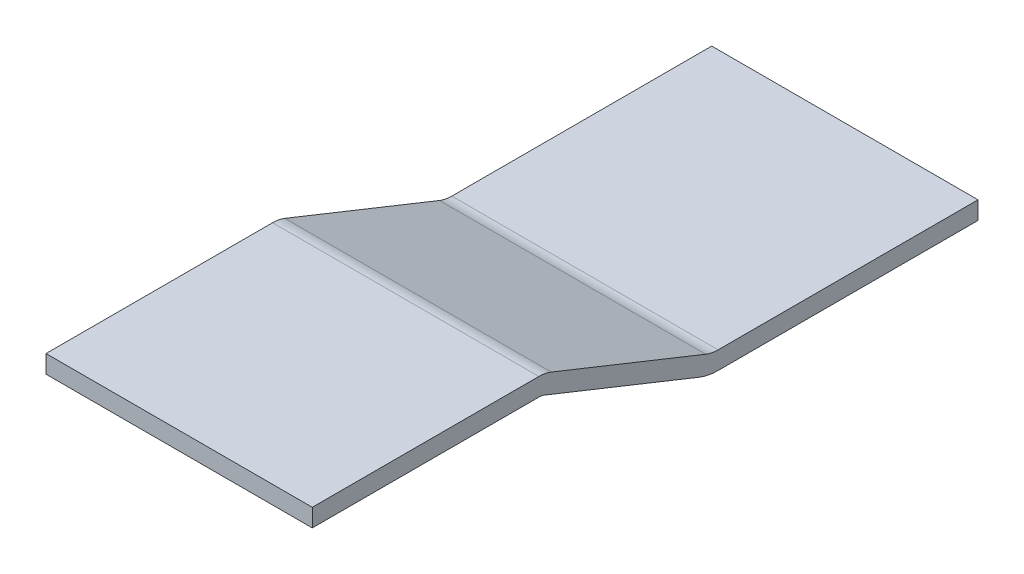
ISO-10303-21;
HEADER;
FILE_DESCRIPTION(('STEP AP214'),'2;1');
FILE_NAME('part.step','',(''),(''),'','','');
FILE_SCHEMA(('AUTOMOTIVE_DESIGN { 1 0 10303 214 1 1 1 1 }'));
ENDSEC;
DATA;
#1=APPLICATION_CONTEXT('core data for automotive mechanical design processes');
#2=APPLICATION_PROTOCOL_DEFINITION('international standard','automotive_design',2000,#1);
#3=PRODUCT_CONTEXT('',#1,'mechanical');
#4=PRODUCT('Part','Part','',(#3));
#5=PRODUCT_RELATED_PRODUCT_CATEGORY('part','',(#4));
#6=PRODUCT_DEFINITION_FORMATION('','',#4);
#7=PRODUCT_DEFINITION_CONTEXT('part definition',#1,'design');
#8=PRODUCT_DEFINITION('design','',#6,#7);
#9=PRODUCT_DEFINITION_SHAPE('','',#8);
#10=(LENGTH_UNIT() NAMED_UNIT(*) SI_UNIT(.MILLI.,.METRE.));
#11=(NAMED_UNIT(*) PLANE_ANGLE_UNIT() SI_UNIT($,.RADIAN.));
#12=(NAMED_UNIT(*) SI_UNIT($,.STERADIAN.) SOLID_ANGLE_UNIT());
#13=UNCERTAINTY_MEASURE_WITH_UNIT(LENGTH_MEASURE(1.E-05),#10,'distance_accuracy_value','');
#14=(GEOMETRIC_REPRESENTATION_CONTEXT(3) GLOBAL_UNCERTAINTY_ASSIGNED_CONTEXT((#13)) GLOBAL_UNIT_ASSIGNED_CONTEXT((#10,
#11,#12)) REPRESENTATION_CONTEXT('',''));
#15=CARTESIAN_POINT('',(0.,0.,0.));
#16=DIRECTION('',(0.,0.,1.));
#17=DIRECTION('',(1.,0.,0.));
#18=AXIS2_PLACEMENT_3D('',#15,#16,#17);
#19=CARTESIAN_POINT('',(25.4,-16.1163,-55.8093473939781));
#20=DIRECTION('',(0.,1.,0.));
#21=DIRECTION('',(0.,0.,1.));
#22=AXIS2_PLACEMENT_3D('',#19,#20,#21);
#23=PLANE('',#22);
#24=DIRECTION('',(0.,0.,-1.));
#25=VECTOR('',#24,1.);
#26=CARTESIAN_POINT('',(-25.4,-16.1163,-55.8093473939781));
#27=LINE('',#26,#25);
#28=CARTESIAN_POINT('',(-25.4,-16.1163,-55.8093473939781));
#29=VERTEX_POINT('',#28);
#30=CARTESIAN_POINT('',(-25.4,-16.1163,-105.386449131326));
#31=VERTEX_POINT('',#30);
#32=EDGE_CURVE('E153',#29,#31,#27,.T.);
#33=ORIENTED_EDGE('',*,*,#32,.T.);
#34=DIRECTION('',(-1.,0.,0.));
#35=VECTOR('',#34,1.);
#36=CARTESIAN_POINT('',(25.4,-16.1163,-105.386449131326));
#37=LINE('',#36,#35);
#38=CARTESIAN_POINT('',(25.4,-16.1163,-105.386449131326));
#39=VERTEX_POINT('',#38);
#40=EDGE_CURVE('E11',#39,#31,#37,.T.);
#41=ORIENTED_EDGE('',*,*,#40,.F.);
#42=DIRECTION('',(0.,0.,-1.));
#43=VECTOR('',#42,1.);
#44=CARTESIAN_POINT('',(25.4,-16.1163,-55.8093473939781));
#45=LINE('',#44,#43);
#46=CARTESIAN_POINT('',(25.4,-16.1163,-55.8093473939781));
#47=VERTEX_POINT('',#46);
#48=EDGE_CURVE('E101',#47,#39,#45,.T.);
#49=ORIENTED_EDGE('',*,*,#48,.F.);
#50=DIRECTION('',(-1.,0.,0.));
#51=VECTOR('',#50,1.);
#52=CARTESIAN_POINT('',(25.4,-16.1163,-55.8093473939781));
#53=LINE('',#52,#51);
#54=EDGE_CURVE('E149',#47,#29,#53,.T.);
#55=ORIENTED_EDGE('',*,*,#54,.T.);
#56=EDGE_LOOP('',(#33,#41,#49,#55));
#57=FACE_BOUND('',#56,.T.);
#58=ADVANCED_FACE('F33',(#57),#23,.F.);
#59=CARTESIAN_POINT('',(25.4,-12.7,-105.386449131326));
#60=DIRECTION('',(0.,0.,-1.));
#61=DIRECTION('',(-1.,0.,0.));
#62=AXIS2_PLACEMENT_3D('',#59,#60,#61);
#63=PLANE('',#62);
#64=DIRECTION('',(0.,-1.,0.));
#65=VECTOR('',#64,1.);
#66=CARTESIAN_POINT('',(-25.4,-12.7,-105.386449131326));
#67=LINE('',#66,#65);
#68=CARTESIAN_POINT('',(-25.4,-12.7,-105.386449131326));
#69=VERTEX_POINT('',#68);
#70=EDGE_CURVE('E156',#69,#31,#67,.T.);
#71=ORIENTED_EDGE('',*,*,#70,.F.);
#72=DIRECTION('',(-1.,0.,0.));
#73=VECTOR('',#72,1.);
#74=CARTESIAN_POINT('',(25.4,-12.7,-105.386449131326));
#75=LINE('',#74,#73);
#76=CARTESIAN_POINT('',(25.4,-12.7,-105.386449131326));
#77=VERTEX_POINT('',#76);
#78=EDGE_CURVE('E41',#77,#69,#75,.T.);
#79=ORIENTED_EDGE('',*,*,#78,.F.);
#80=DIRECTION('',(0.,-1.,0.));
#81=VECTOR('',#80,1.);
#82=CARTESIAN_POINT('',(25.4,-12.7,-105.386449131326));
#83=LINE('',#82,#81);
#84=EDGE_CURVE('E218',#77,#39,#83,.T.);
#85=ORIENTED_EDGE('',*,*,#84,.T.);
#86=ORIENTED_EDGE('',*,*,#40,.T.);
#87=EDGE_LOOP('',(#71,#79,#85,#86));
#88=FACE_BOUND('',#87,.T.);
#89=ADVANCED_FACE('F205',(#88),#63,.T.);
#90=CARTESIAN_POINT('',(25.4,-12.7,-55.8093473939781));
#91=DIRECTION('',(0.,1.,0.));
#92=DIRECTION('',(0.,0.,1.));
#93=AXIS2_PLACEMENT_3D('',#90,#91,#92);
#94=PLANE('',#93);
#95=DIRECTION('',(0.,0.,-1.));
#96=VECTOR('',#95,1.);
#97=CARTESIAN_POINT('',(-25.4,-12.7,-55.8093473939781));
#98=LINE('',#97,#96);
#99=CARTESIAN_POINT('',(-25.4,-12.7,-55.8093473939781));
#100=VERTEX_POINT('',#99);
#101=EDGE_CURVE('E159',#100,#69,#98,.T.);
#102=ORIENTED_EDGE('',*,*,#101,.F.);
#103=DIRECTION('',(-1.,0.,0.));
#104=VECTOR('',#103,1.);
#105=CARTESIAN_POINT('',(25.4,-12.7,-55.8093473939781));
#106=LINE('',#105,#104);
#107=CARTESIAN_POINT('',(25.4,-12.7,-55.8093473939781));
#108=VERTEX_POINT('',#107);
#109=EDGE_CURVE('E195',#108,#100,#106,.T.);
#110=ORIENTED_EDGE('',*,*,#109,.F.);
#111=DIRECTION('',(0.,0.,-1.));
#112=VECTOR('',#111,1.);
#113=CARTESIAN_POINT('',(25.4,-12.7,-55.8093473939781));
#114=LINE('',#113,#112);
#115=EDGE_CURVE('E202',#108,#77,#114,.T.);
#116=ORIENTED_EDGE('',*,*,#115,.T.);
#117=ORIENTED_EDGE('',*,*,#78,.T.);
#118=EDGE_LOOP('',(#102,#110,#116,#117));
#119=FACE_BOUND('',#118,.T.);
#120=ADVANCED_FACE('F200',(#119),#94,.T.);
#121=CARTESIAN_POINT('',(25.4,-6.35,-55.8093473939781));
#122=DIRECTION('',(-1.,0.,0.));
#123=DIRECTION('',(0.,0.,1.));
#124=AXIS2_PLACEMENT_3D('',#121,#122,#123);
#125=CYLINDRICAL_SURFACE('',#124,6.35);
#126=CARTESIAN_POINT('',(-25.4,-6.35,-55.8093473939781));
#127=DIRECTION('',(1.,0.,0.));
#128=DIRECTION('',(0.,0.,-1.));
#129=AXIS2_PLACEMENT_3D('',#126,#127,#128);
#130=CIRCLE('',#129,6.35);
#131=CARTESIAN_POINT('',(-25.4,-12.2458269871214,-53.4510165991295));
#132=VERTEX_POINT('',#131);
#133=EDGE_CURVE('E162',#132,#100,#130,.T.);
#134=ORIENTED_EDGE('',*,*,#133,.F.);
#135=DIRECTION('',(-1.,0.,0.));
#136=VECTOR('',#135,1.);
#137=CARTESIAN_POINT('',(25.4,-12.2458269871214,-53.4510165991295));
#138=LINE('',#137,#136);
#139=CARTESIAN_POINT('',(25.4,-12.2458269871214,-53.4510165991295));
#140=VERTEX_POINT('',#139);
#141=EDGE_CURVE('E193',#140,#132,#138,.T.);
#142=ORIENTED_EDGE('',*,*,#141,.F.);
#143=CARTESIAN_POINT('',(25.4,-6.35,-55.8093473939781));
#144=DIRECTION('',(1.,0.,0.));
#145=DIRECTION('',(0.,0.,-1.));
#146=AXIS2_PLACEMENT_3D('',#143,#144,#145);
#147=CIRCLE('',#146,6.35);
#148=EDGE_CURVE('E215',#140,#108,#147,.T.);
#149=ORIENTED_EDGE('',*,*,#148,.T.);
#150=ORIENTED_EDGE('',*,*,#109,.T.);
#151=EDGE_LOOP('',(#134,#142,#149,#150));
#152=FACE_BOUND('',#151,.T.);
#153=ADVANCED_FACE('F212',(#152),#125,.F.);
#154=CARTESIAN_POINT('',(25.4,-0.454173012878604,-23.9718816635225));
#155=DIRECTION('',(0.,0.928476690885259,-0.371390676354103));
#156=DIRECTION('',(0.,0.371390676354104,0.92847669088526));
#157=AXIS2_PLACEMENT_3D('',#154,#155,#156);
#158=PLANE('',#157);
#159=DIRECTION('',(0.,-0.371390676354103,-0.928476690885259));
#160=VECTOR('',#159,1.);
#161=CARTESIAN_POINT('',(-25.4,-0.454173012878604,-23.9718816635225));
#162=LINE('',#161,#160);
#163=CARTESIAN_POINT('',(-25.4,-0.454173012878605,-23.9718816635225));
#164=VERTEX_POINT('',#163);
#165=EDGE_CURVE('E165',#164,#132,#162,.T.);
#166=ORIENTED_EDGE('',*,*,#165,.F.);
#167=DIRECTION('',(-1.,0.,0.));
#168=VECTOR('',#167,1.);
#169=CARTESIAN_POINT('',(25.4,-0.454173012878605,-23.9718816635225));
#170=LINE('',#169,#168);
#171=CARTESIAN_POINT('',(25.4,-0.454173012878605,-23.9718816635225));
#172=VERTEX_POINT('',#171);
#173=EDGE_CURVE('E191',#172,#164,#170,.T.);
#174=ORIENTED_EDGE('',*,*,#173,.F.);
#175=DIRECTION('',(0.,-0.371390676354103,-0.928476690885259));
#176=VECTOR('',#175,1.);
#177=CARTESIAN_POINT('',(25.4,-0.454173012878604,-23.9718816635225));
#178=LINE('',#177,#176);
#179=EDGE_CURVE('E220',#172,#140,#178,.T.);
#180=ORIENTED_EDGE('',*,*,#179,.T.);
#181=ORIENTED_EDGE('',*,*,#141,.T.);
#182=EDGE_LOOP('',(#166,#174,#180,#181));
#183=FACE_BOUND('',#182,.T.);
#184=ADVANCED_FACE('F320',(#183),#158,.T.);
#185=CARTESIAN_POINT('',(25.4,-6.35,-21.613550868674));
#186=DIRECTION('',(-1.,0.,0.));
#187=DIRECTION('',(0.,0.,1.));
#188=AXIS2_PLACEMENT_3D('',#185,#186,#187);
#189=CYLINDRICAL_SURFACE('',#188,6.35);
#190=CARTESIAN_POINT('',(-25.4,-6.35,-21.613550868674));
#191=DIRECTION('',(-1.,0.,0.));
#192=DIRECTION('',(0.,0.,1.));
#193=AXIS2_PLACEMENT_3D('',#190,#191,#192);
#194=CIRCLE('',#193,6.35);
#195=CARTESIAN_POINT('',(-25.4,0.,-21.613550868674));
#196=VERTEX_POINT('',#195);
#197=EDGE_CURVE('E168',#196,#164,#194,.T.);
#198=ORIENTED_EDGE('',*,*,#197,.F.);
#199=DIRECTION('',(-1.,0.,0.));
#200=VECTOR('',#199,1.);
#201=CARTESIAN_POINT('',(25.4,0.,-21.613550868674));
#202=LINE('',#201,#200);
#203=CARTESIAN_POINT('',(25.4,0.,-21.613550868674));
#204=VERTEX_POINT('',#203);
#205=EDGE_CURVE('E189',#204,#196,#202,.T.);
#206=ORIENTED_EDGE('',*,*,#205,.F.);
#207=CARTESIAN_POINT('',(25.4,-6.35,-21.613550868674));
#208=DIRECTION('',(-1.,0.,0.));
#209=DIRECTION('',(0.,0.,1.));
#210=AXIS2_PLACEMENT_3D('',#207,#208,#209);
#211=CIRCLE('',#210,6.35);
#212=EDGE_CURVE('E226',#204,#172,#211,.T.);
#213=ORIENTED_EDGE('',*,*,#212,.T.);
#214=ORIENTED_EDGE('',*,*,#173,.T.);
#215=EDGE_LOOP('',(#198,#206,#213,#214));
#216=FACE_BOUND('',#215,.T.);
#217=ADVANCED_FACE('F311',(#216),#189,.T.);
#218=CARTESIAN_POINT('',(25.4,0.,21.613550868674));
#219=DIRECTION('',(0.,1.,0.));
#220=DIRECTION('',(0.,0.,1.));
#221=AXIS2_PLACEMENT_3D('',#218,#219,#220);
#222=PLANE('',#221);
#223=DIRECTION('',(0.,0.,-1.));
#224=VECTOR('',#223,1.);
#225=CARTESIAN_POINT('',(-25.4,0.,21.613550868674));
#226=LINE('',#225,#224);
#227=CARTESIAN_POINT('',(-25.4,0.,21.613550868674));
#228=VERTEX_POINT('',#227);
#229=EDGE_CURVE('E171',#228,#196,#226,.T.);
#230=ORIENTED_EDGE('',*,*,#229,.F.);
#231=DIRECTION('',(-1.,0.,0.));
#232=VECTOR('',#231,1.);
#233=CARTESIAN_POINT('',(25.4,0.,21.613550868674));
#234=LINE('',#233,#232);
#235=CARTESIAN_POINT('',(25.4,0.,21.613550868674));
#236=VERTEX_POINT('',#235);
#237=EDGE_CURVE('E187',#236,#228,#234,.T.);
#238=ORIENTED_EDGE('',*,*,#237,.F.);
#239=DIRECTION('',(0.,0.,-1.));
#240=VECTOR('',#239,1.);
#241=CARTESIAN_POINT('',(25.4,0.,21.613550868674));
#242=LINE('',#241,#240);
#243=EDGE_CURVE('E229',#236,#204,#242,.T.);
#244=ORIENTED_EDGE('',*,*,#243,.T.);
#245=ORIENTED_EDGE('',*,*,#205,.T.);
#246=EDGE_LOOP('',(#230,#238,#244,#245));
#247=FACE_BOUND('',#246,.T.);
#248=ADVANCED_FACE('F241',(#247),#222,.T.);
#249=CARTESIAN_POINT('',(25.4,-3.4163,21.613550868674));
#250=DIRECTION('',(0.,0.,1.));
#251=DIRECTION('',(1.,0.,0.));
#252=AXIS2_PLACEMENT_3D('',#249,#250,#251);
#253=PLANE('',#252);
#254=DIRECTION('',(0.,1.,0.));
#255=VECTOR('',#254,1.);
#256=CARTESIAN_POINT('',(-25.4,-3.4163,21.613550868674));
#257=LINE('',#256,#255);
#258=CARTESIAN_POINT('',(-25.4,-3.4163,21.613550868674));
#259=VERTEX_POINT('',#258);
#260=EDGE_CURVE('E174',#259,#228,#257,.T.);
#261=ORIENTED_EDGE('',*,*,#260,.F.);
#262=DIRECTION('',(-1.,0.,0.));
#263=VECTOR('',#262,1.);
#264=CARTESIAN_POINT('',(25.4,-3.4163,21.613550868674));
#265=LINE('',#264,#263);
#266=CARTESIAN_POINT('',(25.4,-3.4163,21.613550868674));
#267=VERTEX_POINT('',#266);
#268=EDGE_CURVE('E185',#267,#259,#265,.T.);
#269=ORIENTED_EDGE('',*,*,#268,.F.);
#270=DIRECTION('',(0.,1.,0.));
#271=VECTOR('',#270,1.);
#272=CARTESIAN_POINT('',(25.4,-3.4163,21.613550868674));
#273=LINE('',#272,#271);
#274=EDGE_CURVE('E232',#267,#236,#273,.T.);
#275=ORIENTED_EDGE('',*,*,#274,.T.);
#276=ORIENTED_EDGE('',*,*,#237,.T.);
#277=EDGE_LOOP('',(#261,#269,#275,#276));
#278=FACE_BOUND('',#277,.T.);
#279=ADVANCED_FACE('F236',(#278),#253,.T.);
#280=CARTESIAN_POINT('',(25.4,-3.4163,21.613550868674));
#281=DIRECTION('',(0.,1.,0.));
#282=DIRECTION('',(0.,0.,1.));
#283=AXIS2_PLACEMENT_3D('',#280,#281,#282);
#284=PLANE('',#283);
#285=DIRECTION('',(0.,0.,-1.));
#286=VECTOR('',#285,1.);
#287=CARTESIAN_POINT('',(-25.4,-3.4163,21.613550868674));
#288=LINE('',#287,#286);
#289=CARTESIAN_POINT('',(-25.4,-3.4163,-21.613550868674));
#290=VERTEX_POINT('',#289);
#291=EDGE_CURVE('E177',#259,#290,#288,.T.);
#292=ORIENTED_EDGE('',*,*,#291,.T.);
#293=DIRECTION('',(-1.,0.,0.));
#294=VECTOR('',#293,1.);
#295=CARTESIAN_POINT('',(25.4,-3.4163,-21.613550868674));
#296=LINE('',#295,#294);
#297=CARTESIAN_POINT('',(25.4,-3.4163,-21.613550868674));
#298=VERTEX_POINT('',#297);
#299=EDGE_CURVE('E144',#298,#290,#296,.T.);
#300=ORIENTED_EDGE('',*,*,#299,.F.);
#301=DIRECTION('',(0.,0.,-1.));
#302=VECTOR('',#301,1.);
#303=CARTESIAN_POINT('',(25.4,-3.4163,21.613550868674));
#304=LINE('',#303,#302);
#305=EDGE_CURVE('E135',#267,#298,#304,.T.);
#306=ORIENTED_EDGE('',*,*,#305,.F.);
#307=ORIENTED_EDGE('',*,*,#268,.T.);
#308=EDGE_LOOP('',(#292,#300,#306,#307));
#309=FACE_BOUND('',#308,.T.);
#310=ADVANCED_FACE('F245',(#309),#284,.F.);
#311=CARTESIAN_POINT('',(25.4,-6.35,-21.613550868674));
#312=DIRECTION('',(-1.,0.,0.));
#313=DIRECTION('',(0.,0.,1.));
#314=AXIS2_PLACEMENT_3D('',#311,#312,#313);
#315=CYLINDRICAL_SURFACE('',#314,2.9337);
#316=CARTESIAN_POINT('',(-25.4,-6.35,-21.613550868674));
#317=DIRECTION('',(1.,0.,0.));
#318=DIRECTION('',(0.,0.,-1.));
#319=AXIS2_PLACEMENT_3D('',#316,#317,#318);
#320=CIRCLE('',#319,2.9337);
#321=CARTESIAN_POINT('',(-25.4,-3.62612793194992,-22.703099695894));
#322=VERTEX_POINT('',#321);
#323=EDGE_CURVE('E143',#290,#322,#320,.F.);
#324=ORIENTED_EDGE('',*,*,#323,.T.);
#325=DIRECTION('',(-1.,0.,0.));
#326=VECTOR('',#325,1.);
#327=CARTESIAN_POINT('',(25.4,-3.62612793194992,-22.703099695894));
#328=LINE('',#327,#326);
#329=CARTESIAN_POINT('',(25.4,-3.62612793194992,-22.703099695894));
#330=VERTEX_POINT('',#329);
#331=EDGE_CURVE('E140',#330,#322,#328,.T.);
#332=ORIENTED_EDGE('',*,*,#331,.F.);
#333=CARTESIAN_POINT('',(25.4,-6.35,-21.613550868674));
#334=DIRECTION('',(1.,0.,0.));
#335=DIRECTION('',(0.,0.,-1.));
#336=AXIS2_PLACEMENT_3D('',#333,#334,#335);
#337=CIRCLE('',#336,2.9337);
#338=EDGE_CURVE('E128',#298,#330,#337,.F.);
#339=ORIENTED_EDGE('',*,*,#338,.F.);
#340=ORIENTED_EDGE('',*,*,#299,.T.);
#341=EDGE_LOOP('',(#324,#332,#339,#340));
#342=FACE_BOUND('',#341,.T.);
#343=ADVANCED_FACE('F141',(#342),#315,.F.);
#344=CARTESIAN_POINT('',(25.4,-3.62612793194992,-22.703099695894));
#345=DIRECTION('',(0.,0.928476690885259,-0.371390676354103));
#346=DIRECTION('',(0.,0.371390676354104,0.92847669088526));
#347=AXIS2_PLACEMENT_3D('',#344,#345,#346);
#348=PLANE('',#347);
#349=DIRECTION('',(0.,-0.371390676354103,-0.928476690885259));
#350=VECTOR('',#349,1.);
#351=CARTESIAN_POINT('',(-25.4,-3.62612793194992,-22.703099695894));
#352=LINE('',#351,#350);
#353=CARTESIAN_POINT('',(-25.4,-15.4177819061927,-52.182234631501));
#354=VERTEX_POINT('',#353);
#355=EDGE_CURVE('E89',#322,#354,#352,.T.);
#356=ORIENTED_EDGE('',*,*,#355,.T.);
#357=DIRECTION('',(-1.,0.,0.));
#358=VECTOR('',#357,1.);
#359=CARTESIAN_POINT('',(25.4,-15.4177819061927,-52.182234631501));
#360=LINE('',#359,#358);
#361=CARTESIAN_POINT('',(25.4,-15.4177819061927,-52.182234631501));
#362=VERTEX_POINT('',#361);
#363=EDGE_CURVE('E145',#362,#354,#360,.T.);
#364=ORIENTED_EDGE('',*,*,#363,.F.);
#365=DIRECTION('',(0.,-0.371390676354103,-0.928476690885259));
#366=VECTOR('',#365,1.);
#367=CARTESIAN_POINT('',(25.4,-3.62612793194992,-22.703099695894));
#368=LINE('',#367,#366);
#369=EDGE_CURVE('E132',#330,#362,#368,.T.);
#370=ORIENTED_EDGE('',*,*,#369,.F.);
#371=ORIENTED_EDGE('',*,*,#331,.T.);
#372=EDGE_LOOP('',(#356,#364,#370,#371));
#373=FACE_BOUND('',#372,.T.);
#374=ADVANCED_FACE('F147',(#373),#348,.F.);
#375=CARTESIAN_POINT('',(25.4,-6.35,-55.8093473939781));
#376=DIRECTION('',(-1.,0.,0.));
#377=DIRECTION('',(0.,0.,1.));
#378=AXIS2_PLACEMENT_3D('',#375,#376,#377);
#379=CYLINDRICAL_SURFACE('',#378,9.7663);
#380=CARTESIAN_POINT('',(-25.4,-6.35,-55.8093473939781));
#381=DIRECTION('',(1.,0.,0.));
#382=DIRECTION('',(0.,0.,-1.));
#383=AXIS2_PLACEMENT_3D('',#380,#381,#382);
#384=CIRCLE('',#383,9.7663);
#385=EDGE_CURVE('E95',#354,#29,#384,.T.);
#386=ORIENTED_EDGE('',*,*,#385,.T.);
#387=ORIENTED_EDGE('',*,*,#54,.F.);
#388=CARTESIAN_POINT('',(25.4,-6.35,-55.8093473939781));
#389=DIRECTION('',(1.,0.,0.));
#390=DIRECTION('',(0.,0.,-1.));
#391=AXIS2_PLACEMENT_3D('',#388,#389,#390);
#392=CIRCLE('',#391,9.7663);
#393=EDGE_CURVE('E49',#362,#47,#392,.T.);
#394=ORIENTED_EDGE('',*,*,#393,.F.);
#395=ORIENTED_EDGE('',*,*,#363,.T.);
#396=EDGE_LOOP('',(#386,#387,#394,#395));
#397=FACE_BOUND('',#396,.T.);
#398=ADVANCED_FACE('F259',(#397),#379,.T.);
#399=CARTESIAN_POINT('',(25.4,-6.35,-55.8093473939781));
#400=DIRECTION('',(1.,0.,0.));
#401=DIRECTION('',(0.,0.,-1.));
#402=AXIS2_PLACEMENT_3D('',#399,#400,#401);
#403=PLANE('',#402);
#404=ORIENTED_EDGE('',*,*,#48,.T.);
#405=ORIENTED_EDGE('',*,*,#84,.F.);
#406=ORIENTED_EDGE('',*,*,#115,.F.);
#407=ORIENTED_EDGE('',*,*,#148,.F.);
#408=ORIENTED_EDGE('',*,*,#179,.F.);
#409=ORIENTED_EDGE('',*,*,#212,.F.);
#410=ORIENTED_EDGE('',*,*,#243,.F.);
#411=ORIENTED_EDGE('',*,*,#274,.F.);
#412=ORIENTED_EDGE('',*,*,#305,.T.);
#413=ORIENTED_EDGE('',*,*,#338,.T.);
#414=ORIENTED_EDGE('',*,*,#369,.T.);
#415=ORIENTED_EDGE('',*,*,#393,.T.);
#416=EDGE_LOOP('',(#404,#405,#406,#407,#408,#409,#410,#411,#412,#413,#414,#415));
#417=FACE_BOUND('',#416,.T.);
#418=ADVANCED_FACE('F130',(#417),#403,.T.);
#419=CARTESIAN_POINT('',(-25.4,-6.35,-55.8093473939781));
#420=DIRECTION('',(1.,0.,0.));
#421=DIRECTION('',(0.,0.,-1.));
#422=AXIS2_PLACEMENT_3D('',#419,#420,#421);
#423=PLANE('',#422);
#424=ORIENTED_EDGE('',*,*,#32,.F.);
#425=ORIENTED_EDGE('',*,*,#385,.F.);
#426=ORIENTED_EDGE('',*,*,#355,.F.);
#427=ORIENTED_EDGE('',*,*,#323,.F.);
#428=ORIENTED_EDGE('',*,*,#291,.F.);
#429=ORIENTED_EDGE('',*,*,#260,.T.);
#430=ORIENTED_EDGE('',*,*,#229,.T.);
#431=ORIENTED_EDGE('',*,*,#197,.T.);
#432=ORIENTED_EDGE('',*,*,#165,.T.);
#433=ORIENTED_EDGE('',*,*,#133,.T.);
#434=ORIENTED_EDGE('',*,*,#101,.T.);
#435=ORIENTED_EDGE('',*,*,#70,.T.);
#436=EDGE_LOOP('',(#424,#425,#426,#427,#428,#429,#430,#431,#432,#433,#434,#435));
#437=FACE_BOUND('',#436,.T.);
#438=ADVANCED_FACE('F208',(#437),#423,.F.);
#439=CLOSED_SHELL('',(#58,#89,#120,#153,#184,#217,#248,#279,#310,#343,#374,#398,#418,#438));
#440=MANIFOLD_SOLID_BREP('B2',#439);
#441=ADVANCED_BREP_SHAPE_REPRESENTATION('',(#18,#440),#14);
#442=SHAPE_DEFINITION_REPRESENTATION(#9,#441);
ENDSEC;
END-ISO-10303-21;
